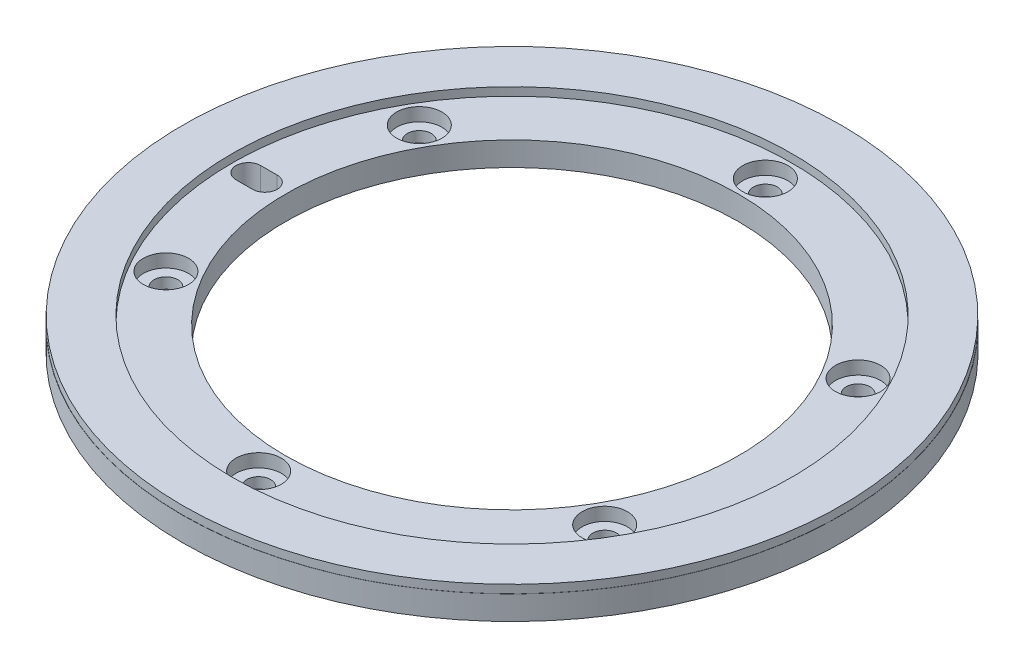
ISO-10303-21;
HEADER;
FILE_DESCRIPTION(('STEP AP214'),'2;1');
FILE_NAME('part.step','',(''),(''),'','','');
FILE_SCHEMA(('AUTOMOTIVE_DESIGN { 1 0 10303 214 1 1 1 1 }'));
ENDSEC;
DATA;
#1=APPLICATION_CONTEXT('core data for automotive mechanical design processes');
#2=APPLICATION_PROTOCOL_DEFINITION('international standard','automotive_design',2000,#1);
#3=PRODUCT_CONTEXT('',#1,'mechanical');
#4=PRODUCT('Part','Part','',(#3));
#5=PRODUCT_RELATED_PRODUCT_CATEGORY('part','',(#4));
#6=PRODUCT_DEFINITION_FORMATION('','',#4);
#7=PRODUCT_DEFINITION_CONTEXT('part definition',#1,'design');
#8=PRODUCT_DEFINITION('design','',#6,#7);
#9=PRODUCT_DEFINITION_SHAPE('','',#8);
#10=(LENGTH_UNIT() NAMED_UNIT(*) SI_UNIT(.MILLI.,.METRE.));
#11=(NAMED_UNIT(*) PLANE_ANGLE_UNIT() SI_UNIT($,.RADIAN.));
#12=(NAMED_UNIT(*) SI_UNIT($,.STERADIAN.) SOLID_ANGLE_UNIT());
#13=UNCERTAINTY_MEASURE_WITH_UNIT(LENGTH_MEASURE(1.E-05),#10,'distance_accuracy_value','');
#14=(GEOMETRIC_REPRESENTATION_CONTEXT(3) GLOBAL_UNCERTAINTY_ASSIGNED_CONTEXT((#13)) GLOBAL_UNIT_ASSIGNED_CONTEXT((#10,
#11,#12)) REPRESENTATION_CONTEXT('',''));
#15=CARTESIAN_POINT('',(0.,0.,0.));
#16=DIRECTION('',(0.,0.,1.));
#17=DIRECTION('',(1.,0.,0.));
#18=AXIS2_PLACEMENT_3D('',#15,#16,#17);
#19=CARTESIAN_POINT('',(-27.5,2.9,0.));
#20=DIRECTION('',(0.,-1.,0.));
#21=DIRECTION('',(0.,0.,-1.));
#22=AXIS2_PLACEMENT_3D('',#19,#20,#21);
#23=PLANE('',#22);
#24=CARTESIAN_POINT('',(0.,2.9,0.));
#25=DIRECTION('',(0.,-1.,0.));
#26=DIRECTION('',(0.,0.,-1.));
#27=AXIS2_PLACEMENT_3D('',#24,#25,#26);
#28=CIRCLE('',#27,40.);
#29=CARTESIAN_POINT('',(0.,2.9,-40.));
#30=VERTEX_POINT('',#29);
#31=EDGE_CURVE('E166',#30,#30,#28,.T.);
#32=ORIENTED_EDGE('',*,*,#31,.F.);
#33=EDGE_LOOP('',(#32));
#34=FACE_BOUND('',#33,.T.);
#35=CARTESIAN_POINT('',(0.,2.9,0.));
#36=DIRECTION('',(0.,-1.,0.));
#37=DIRECTION('',(0.,0.,-1.));
#38=AXIS2_PLACEMENT_3D('',#35,#36,#37);
#39=CIRCLE('',#38,39.98);
#40=CARTESIAN_POINT('',(0.,2.9,-39.98));
#41=VERTEX_POINT('',#40);
#42=EDGE_CURVE('E11',#41,#41,#39,.F.);
#43=ORIENTED_EDGE('',*,*,#42,.F.);
#44=EDGE_LOOP('',(#43));
#45=FACE_BOUND('',#44,.T.);
#46=ADVANCED_FACE('F31',(#34,#45),#23,.F.);
#47=CARTESIAN_POINT('',(0.,-3.24386032345393,0.));
#48=DIRECTION('',(0.,-1.,0.));
#49=DIRECTION('',(0.,0.,-1.));
#50=AXIS2_PLACEMENT_3D('',#47,#48,#49);
#51=CYLINDRICAL_SURFACE('',#50,27.5);
#52=CARTESIAN_POINT('',(0.,2.9,0.));
#53=DIRECTION('',(0.,-1.,0.));
#54=DIRECTION('',(0.,0.,-1.));
#55=AXIS2_PLACEMENT_3D('',#52,#53,#54);
#56=CIRCLE('',#55,27.5);
#57=CARTESIAN_POINT('',(0.,2.9,-27.5));
#58=VERTEX_POINT('',#57);
#59=EDGE_CURVE('E169',#58,#58,#56,.T.);
#60=ORIENTED_EDGE('',*,*,#59,.F.);
#61=EDGE_LOOP('',(#60));
#62=FACE_BOUND('',#61,.T.);
#63=CARTESIAN_POINT('',(0.,0.,0.));
#64=DIRECTION('',(0.,-1.,0.));
#65=DIRECTION('',(0.,0.,-1.));
#66=AXIS2_PLACEMENT_3D('',#63,#64,#65);
#67=CIRCLE('',#66,27.5);
#68=CARTESIAN_POINT('',(0.,0.,-27.5));
#69=VERTEX_POINT('',#68);
#70=EDGE_CURVE('E160',#69,#69,#67,.T.);
#71=ORIENTED_EDGE('',*,*,#70,.T.);
#72=EDGE_LOOP('',(#71));
#73=FACE_BOUND('',#72,.T.);
#74=ADVANCED_FACE('F33',(#62,#73),#51,.F.);
#75=CARTESIAN_POINT('',(0.,2.9,0.));
#76=DIRECTION('',(0.,1.,0.));
#77=DIRECTION('',(0.,0.,1.));
#78=AXIS2_PLACEMENT_3D('',#75,#76,#77);
#79=CIRCLE('',#78,34.);
#80=CARTESIAN_POINT('',(0.,2.9,34.));
#81=VERTEX_POINT('',#80);
#82=EDGE_CURVE('E202',#81,#81,#79,.T.);
#83=ORIENTED_EDGE('',*,*,#82,.T.);
#84=EDGE_LOOP('',(#83));
#85=FACE_BOUND('',#84,.T.);
#86=DIRECTION('',(1.,0.,0.));
#87=VECTOR('',#86,1.);
#88=CARTESIAN_POINT('',(-32.,2.9,1.5));
#89=LINE('',#88,#87);
#90=CARTESIAN_POINT('',(-32.,2.9,1.5));
#91=VERTEX_POINT('',#90);
#92=CARTESIAN_POINT('',(-30.,2.9,1.5));
#93=VERTEX_POINT('',#92);
#94=EDGE_CURVE('E84',#91,#93,#89,.T.);
#95=ORIENTED_EDGE('',*,*,#94,.F.);
#96=CARTESIAN_POINT('',(-32.,2.9,0.));
#97=DIRECTION('',(0.,1.,0.));
#98=DIRECTION('',(0.,0.,1.));
#99=AXIS2_PLACEMENT_3D('',#96,#97,#98);
#100=CIRCLE('',#99,1.5);
#101=CARTESIAN_POINT('',(-32.,2.9,-1.5));
#102=VERTEX_POINT('',#101);
#103=EDGE_CURVE('E46',#102,#91,#100,.T.);
#104=ORIENTED_EDGE('',*,*,#103,.F.);
#105=DIRECTION('',(-1.,0.,0.));
#106=VECTOR('',#105,1.);
#107=CARTESIAN_POINT('',(-32.,2.9,-1.5));
#108=LINE('',#107,#106);
#109=CARTESIAN_POINT('',(-30.,2.9,-1.5));
#110=VERTEX_POINT('',#109);
#111=EDGE_CURVE('E91',#110,#102,#108,.T.);
#112=ORIENTED_EDGE('',*,*,#111,.F.);
#113=CARTESIAN_POINT('',(-30.,2.9,0.));
#114=DIRECTION('',(0.,1.,0.));
#115=DIRECTION('',(0.,0.,1.));
#116=AXIS2_PLACEMENT_3D('',#113,#114,#115);
#117=CIRCLE('',#116,1.5);
#118=EDGE_CURVE('E75',#93,#110,#117,.T.);
#119=ORIENTED_EDGE('',*,*,#118,.F.);
#120=EDGE_LOOP('',(#95,#104,#112,#119));
#121=FACE_BOUND('',#120,.T.);
#122=CARTESIAN_POINT('',(-26.6302811663713,2.9,-15.3750000000003));
#123=DIRECTION('',(0.,-1.,0.));
#124=DIRECTION('',(0.,0.,-1.));
#125=AXIS2_PLACEMENT_3D('',#122,#123,#124);
#126=CIRCLE('',#125,2.75);
#127=CARTESIAN_POINT('',(-26.6302811663713,2.9,-18.1250000000003));
#128=VERTEX_POINT('',#127);
#129=EDGE_CURVE('E109',#128,#128,#126,.T.);
#130=ORIENTED_EDGE('',*,*,#129,.T.);
#131=EDGE_LOOP('',(#130));
#132=FACE_BOUND('',#131,.T.);
#133=CARTESIAN_POINT('',(-26.6302811663716,2.9,15.3749999999998));
#134=DIRECTION('',(0.,-1.,0.));
#135=DIRECTION('',(0.,0.,-1.));
#136=AXIS2_PLACEMENT_3D('',#133,#134,#135);
#137=CIRCLE('',#136,2.75);
#138=CARTESIAN_POINT('',(-26.6302811663716,2.9,12.6249999999998));
#139=VERTEX_POINT('',#138);
#140=EDGE_CURVE('E119',#139,#139,#137,.T.);
#141=ORIENTED_EDGE('',*,*,#140,.T.);
#142=EDGE_LOOP('',(#141));
#143=FACE_BOUND('',#142,.T.);
#144=CARTESIAN_POINT('',(0.,2.9,30.75));
#145=DIRECTION('',(0.,-1.,0.));
#146=DIRECTION('',(0.,0.,-1.));
#147=AXIS2_PLACEMENT_3D('',#144,#145,#146);
#148=CIRCLE('',#147,2.75);
#149=CARTESIAN_POINT('',(0.,2.9,28.));
#150=VERTEX_POINT('',#149);
#151=EDGE_CURVE('E129',#150,#150,#148,.T.);
#152=ORIENTED_EDGE('',*,*,#151,.T.);
#153=EDGE_LOOP('',(#152));
#154=FACE_BOUND('',#153,.T.);
#155=CARTESIAN_POINT('',(26.6302811663714,2.9,15.3750000000001));
#156=DIRECTION('',(0.,-1.,0.));
#157=DIRECTION('',(0.,0.,-1.));
#158=AXIS2_PLACEMENT_3D('',#155,#156,#157);
#159=CIRCLE('',#158,2.75);
#160=CARTESIAN_POINT('',(26.6302811663714,2.9,12.6250000000001));
#161=VERTEX_POINT('',#160);
#162=EDGE_CURVE('E139',#161,#161,#159,.T.);
#163=ORIENTED_EDGE('',*,*,#162,.T.);
#164=EDGE_LOOP('',(#163));
#165=FACE_BOUND('',#164,.T.);
#166=CARTESIAN_POINT('',(26.6302811663715,2.9,-15.3749999999999));
#167=DIRECTION('',(0.,-1.,0.));
#168=DIRECTION('',(0.,0.,-1.));
#169=AXIS2_PLACEMENT_3D('',#166,#167,#168);
#170=CIRCLE('',#169,2.75);
#171=CARTESIAN_POINT('',(26.6302811663715,2.9,-18.1249999999999));
#172=VERTEX_POINT('',#171);
#173=EDGE_CURVE('E149',#172,#172,#170,.T.);
#174=ORIENTED_EDGE('',*,*,#173,.T.);
#175=EDGE_LOOP('',(#174));
#176=FACE_BOUND('',#175,.T.);
#177=CARTESIAN_POINT('',(0.,2.9,-30.75));
#178=DIRECTION('',(0.,-1.,0.));
#179=DIRECTION('',(0.,0.,-1.));
#180=AXIS2_PLACEMENT_3D('',#177,#178,#179);
#181=CIRCLE('',#180,2.75);
#182=CARTESIAN_POINT('',(0.,2.9,-33.5));
#183=VERTEX_POINT('',#182);
#184=EDGE_CURVE('E159',#183,#183,#181,.T.);
#185=ORIENTED_EDGE('',*,*,#184,.T.);
#186=EDGE_LOOP('',(#185));
#187=FACE_BOUND('',#186,.T.);
#188=ORIENTED_EDGE('',*,*,#59,.T.);
#189=EDGE_LOOP('',(#188));
#190=FACE_BOUND('',#189,.T.);
#191=ADVANCED_FACE('F88',(#85,#121,#132,#143,#154,#165,#176,#187,#190),#23,.F.);
#192=CARTESIAN_POINT('',(0.,-3.24386032345393,0.));
#193=DIRECTION('',(0.,-1.,0.));
#194=DIRECTION('',(0.,0.,-1.));
#195=AXIS2_PLACEMENT_3D('',#192,#193,#194);
#196=CYLINDRICAL_SURFACE('',#195,40.);
#197=CARTESIAN_POINT('',(0.,0.,0.));
#198=DIRECTION('',(0.,-1.,0.));
#199=DIRECTION('',(0.,0.,-1.));
#200=AXIS2_PLACEMENT_3D('',#197,#198,#199);
#201=CIRCLE('',#200,40.);
#202=CARTESIAN_POINT('',(0.,0.,-40.));
#203=VERTEX_POINT('',#202);
#204=EDGE_CURVE('E163',#203,#203,#201,.T.);
#205=ORIENTED_EDGE('',*,*,#204,.F.);
#206=EDGE_LOOP('',(#205));
#207=FACE_BOUND('',#206,.T.);
#208=ORIENTED_EDGE('',*,*,#31,.T.);
#209=EDGE_LOOP('',(#208));
#210=FACE_BOUND('',#209,.T.);
#211=ADVANCED_FACE('F234',(#207,#210),#196,.T.);
#212=CARTESIAN_POINT('',(-27.5,0.,0.));
#213=DIRECTION('',(0.,1.,0.));
#214=DIRECTION('',(0.,0.,1.));
#215=AXIS2_PLACEMENT_3D('',#212,#213,#214);
#216=PLANE('',#215);
#217=DIRECTION('',(-1.,0.,0.));
#218=VECTOR('',#217,1.);
#219=CARTESIAN_POINT('',(-27.5,0.,-1.5));
#220=LINE('',#219,#218);
#221=CARTESIAN_POINT('',(-30.,0.,-1.5));
#222=VERTEX_POINT('',#221);
#223=CARTESIAN_POINT('',(-32.,0.,-1.5));
#224=VERTEX_POINT('',#223);
#225=EDGE_CURVE('E187',#222,#224,#220,.T.);
#226=ORIENTED_EDGE('',*,*,#225,.T.);
#227=CARTESIAN_POINT('',(-32.,0.,0.));
#228=DIRECTION('',(0.,1.,0.));
#229=DIRECTION('',(0.,0.,1.));
#230=AXIS2_PLACEMENT_3D('',#227,#228,#229);
#231=CIRCLE('',#230,1.5);
#232=CARTESIAN_POINT('',(-32.,0.,1.5));
#233=VERTEX_POINT('',#232);
#234=EDGE_CURVE('E39',#224,#233,#231,.T.);
#235=ORIENTED_EDGE('',*,*,#234,.T.);
#236=DIRECTION('',(1.,0.,0.));
#237=VECTOR('',#236,1.);
#238=CARTESIAN_POINT('',(-27.5,0.,1.5));
#239=LINE('',#238,#237);
#240=CARTESIAN_POINT('',(-30.,0.,1.5));
#241=VERTEX_POINT('',#240);
#242=EDGE_CURVE('E172',#233,#241,#239,.T.);
#243=ORIENTED_EDGE('',*,*,#242,.T.);
#244=CARTESIAN_POINT('',(-30.,0.,0.));
#245=DIRECTION('',(0.,1.,0.));
#246=DIRECTION('',(0.,0.,1.));
#247=AXIS2_PLACEMENT_3D('',#244,#245,#246);
#248=CIRCLE('',#247,1.5);
#249=EDGE_CURVE('E78',#241,#222,#248,.T.);
#250=ORIENTED_EDGE('',*,*,#249,.T.);
#251=EDGE_LOOP('',(#226,#235,#243,#250));
#252=FACE_BOUND('',#251,.T.);
#253=CARTESIAN_POINT('',(-26.6302811663713,0.,-15.3750000000003));
#254=DIRECTION('',(0.,1.,0.));
#255=DIRECTION('',(0.,0.,1.));
#256=AXIS2_PLACEMENT_3D('',#253,#254,#255);
#257=CIRCLE('',#256,1.45);
#258=CARTESIAN_POINT('',(-26.6302811663713,0.,-13.9250000000003));
#259=VERTEX_POINT('',#258);
#260=EDGE_CURVE('E106',#259,#259,#257,.T.);
#261=ORIENTED_EDGE('',*,*,#260,.T.);
#262=EDGE_LOOP('',(#261));
#263=FACE_BOUND('',#262,.T.);
#264=CARTESIAN_POINT('',(-26.6302811663716,0.,15.3749999999998));
#265=DIRECTION('',(0.,1.,0.));
#266=DIRECTION('',(0.,0.,1.));
#267=AXIS2_PLACEMENT_3D('',#264,#265,#266);
#268=CIRCLE('',#267,1.45);
#269=CARTESIAN_POINT('',(-26.6302811663716,0.,16.8249999999998));
#270=VERTEX_POINT('',#269);
#271=EDGE_CURVE('E116',#270,#270,#268,.T.);
#272=ORIENTED_EDGE('',*,*,#271,.T.);
#273=EDGE_LOOP('',(#272));
#274=FACE_BOUND('',#273,.T.);
#275=CARTESIAN_POINT('',(0.,0.,30.75));
#276=DIRECTION('',(0.,1.,0.));
#277=DIRECTION('',(0.,0.,1.));
#278=AXIS2_PLACEMENT_3D('',#275,#276,#277);
#279=CIRCLE('',#278,1.45);
#280=CARTESIAN_POINT('',(0.,0.,32.2));
#281=VERTEX_POINT('',#280);
#282=EDGE_CURVE('E126',#281,#281,#279,.T.);
#283=ORIENTED_EDGE('',*,*,#282,.T.);
#284=EDGE_LOOP('',(#283));
#285=FACE_BOUND('',#284,.T.);
#286=CARTESIAN_POINT('',(26.6302811663714,0.,15.3750000000001));
#287=DIRECTION('',(0.,1.,0.));
#288=DIRECTION('',(0.,0.,1.));
#289=AXIS2_PLACEMENT_3D('',#286,#287,#288);
#290=CIRCLE('',#289,1.45);
#291=CARTESIAN_POINT('',(26.6302811663714,0.,16.8250000000001));
#292=VERTEX_POINT('',#291);
#293=EDGE_CURVE('E136',#292,#292,#290,.T.);
#294=ORIENTED_EDGE('',*,*,#293,.T.);
#295=EDGE_LOOP('',(#294));
#296=FACE_BOUND('',#295,.T.);
#297=CARTESIAN_POINT('',(26.6302811663715,0.,-15.3749999999999));
#298=DIRECTION('',(0.,1.,0.));
#299=DIRECTION('',(0.,0.,1.));
#300=AXIS2_PLACEMENT_3D('',#297,#298,#299);
#301=CIRCLE('',#300,1.45);
#302=CARTESIAN_POINT('',(26.6302811663715,0.,-13.9249999999999));
#303=VERTEX_POINT('',#302);
#304=EDGE_CURVE('E146',#303,#303,#301,.T.);
#305=ORIENTED_EDGE('',*,*,#304,.T.);
#306=EDGE_LOOP('',(#305));
#307=FACE_BOUND('',#306,.T.);
#308=CARTESIAN_POINT('',(0.,0.,-30.75));
#309=DIRECTION('',(0.,1.,0.));
#310=DIRECTION('',(0.,0.,1.));
#311=AXIS2_PLACEMENT_3D('',#308,#309,#310);
#312=CIRCLE('',#311,1.45);
#313=CARTESIAN_POINT('',(0.,0.,-29.3));
#314=VERTEX_POINT('',#313);
#315=EDGE_CURVE('E156',#314,#314,#312,.T.);
#316=ORIENTED_EDGE('',*,*,#315,.T.);
#317=EDGE_LOOP('',(#316));
#318=FACE_BOUND('',#317,.T.);
#319=ORIENTED_EDGE('',*,*,#70,.F.);
#320=EDGE_LOOP('',(#319));
#321=FACE_BOUND('',#320,.T.);
#322=ORIENTED_EDGE('',*,*,#204,.T.);
#323=EDGE_LOOP('',(#322));
#324=FACE_BOUND('',#323,.T.);
#325=ADVANCED_FACE('F191',(#252,#263,#274,#285,#296,#307,#318,#321,#324),#216,.F.);
#326=CARTESIAN_POINT('',(0.,3.4,-30.75));
#327=DIRECTION('',(0.,1.,0.));
#328=DIRECTION('',(0.,0.,1.));
#329=AXIS2_PLACEMENT_3D('',#326,#327,#328);
#330=CYLINDRICAL_SURFACE('',#329,2.75);
#331=CARTESIAN_POINT('',(0.,1.3,-30.75));
#332=DIRECTION('',(0.,1.,0.));
#333=DIRECTION('',(0.,0.,1.));
#334=AXIS2_PLACEMENT_3D('',#331,#332,#333);
#335=CIRCLE('',#334,2.75);
#336=CARTESIAN_POINT('',(0.,1.3,-28.));
#337=VERTEX_POINT('',#336);
#338=EDGE_CURVE('E150',#337,#337,#335,.T.);
#339=ORIENTED_EDGE('',*,*,#338,.F.);
#340=EDGE_LOOP('',(#339));
#341=FACE_BOUND('',#340,.T.);
#342=ORIENTED_EDGE('',*,*,#184,.F.);
#343=EDGE_LOOP('',(#342));
#344=FACE_BOUND('',#343,.T.);
#345=ADVANCED_FACE('F304',(#341,#344),#330,.F.);
#346=CARTESIAN_POINT('',(0.,3.4,-30.75));
#347=DIRECTION('',(0.,1.,0.));
#348=DIRECTION('',(0.,0.,1.));
#349=AXIS2_PLACEMENT_3D('',#346,#347,#348);
#350=CYLINDRICAL_SURFACE('',#349,1.45);
#351=ORIENTED_EDGE('',*,*,#315,.F.);
#352=EDGE_LOOP('',(#351));
#353=FACE_BOUND('',#352,.T.);
#354=CARTESIAN_POINT('',(0.,1.3,-30.75));
#355=DIRECTION('',(0.,1.,0.));
#356=DIRECTION('',(0.,0.,1.));
#357=AXIS2_PLACEMENT_3D('',#354,#355,#356);
#358=CIRCLE('',#357,1.45);
#359=CARTESIAN_POINT('',(0.,1.3,-29.3));
#360=VERTEX_POINT('',#359);
#361=EDGE_CURVE('E153',#360,#360,#358,.T.);
#362=ORIENTED_EDGE('',*,*,#361,.T.);
#363=EDGE_LOOP('',(#362));
#364=FACE_BOUND('',#363,.T.);
#365=ADVANCED_FACE('F463',(#353,#364),#350,.F.);
#366=CARTESIAN_POINT('',(1.45,1.3,-30.75));
#367=DIRECTION('',(0.,-1.,0.));
#368=DIRECTION('',(0.,0.,-1.));
#369=AXIS2_PLACEMENT_3D('',#366,#367,#368);
#370=PLANE('',#369);
#371=ORIENTED_EDGE('',*,*,#361,.F.);
#372=EDGE_LOOP('',(#371));
#373=FACE_BOUND('',#372,.T.);
#374=ORIENTED_EDGE('',*,*,#338,.T.);
#375=EDGE_LOOP('',(#374));
#376=FACE_BOUND('',#375,.T.);
#377=ADVANCED_FACE('F453',(#373,#376),#370,.F.);
#378=CARTESIAN_POINT('',(26.6302811663715,3.4,-15.3749999999999));
#379=DIRECTION('',(0.,1.,0.));
#380=DIRECTION('',(0.,0.,1.));
#381=AXIS2_PLACEMENT_3D('',#378,#379,#380);
#382=CYLINDRICAL_SURFACE('',#381,2.75);
#383=CARTESIAN_POINT('',(26.6302811663715,1.3,-15.3749999999999));
#384=DIRECTION('',(0.,1.,0.));
#385=DIRECTION('',(0.,0.,1.));
#386=AXIS2_PLACEMENT_3D('',#383,#384,#385);
#387=CIRCLE('',#386,2.75);
#388=CARTESIAN_POINT('',(26.6302811663715,1.3,-12.6249999999999));
#389=VERTEX_POINT('',#388);
#390=EDGE_CURVE('E140',#389,#389,#387,.T.);
#391=ORIENTED_EDGE('',*,*,#390,.F.);
#392=EDGE_LOOP('',(#391));
#393=FACE_BOUND('',#392,.T.);
#394=ORIENTED_EDGE('',*,*,#173,.F.);
#395=EDGE_LOOP('',(#394));
#396=FACE_BOUND('',#395,.T.);
#397=ADVANCED_FACE('F443',(#393,#396),#382,.F.);
#398=CARTESIAN_POINT('',(26.6302811663715,3.4,-15.3749999999999));
#399=DIRECTION('',(0.,1.,0.));
#400=DIRECTION('',(0.,0.,1.));
#401=AXIS2_PLACEMENT_3D('',#398,#399,#400);
#402=CYLINDRICAL_SURFACE('',#401,1.45);
#403=ORIENTED_EDGE('',*,*,#304,.F.);
#404=EDGE_LOOP('',(#403));
#405=FACE_BOUND('',#404,.T.);
#406=CARTESIAN_POINT('',(26.6302811663715,1.3,-15.3749999999999));
#407=DIRECTION('',(0.,1.,0.));
#408=DIRECTION('',(0.,0.,1.));
#409=AXIS2_PLACEMENT_3D('',#406,#407,#408);
#410=CIRCLE('',#409,1.45);
#411=CARTESIAN_POINT('',(26.6302811663715,1.3,-13.9249999999999));
#412=VERTEX_POINT('',#411);
#413=EDGE_CURVE('E143',#412,#412,#410,.T.);
#414=ORIENTED_EDGE('',*,*,#413,.T.);
#415=EDGE_LOOP('',(#414));
#416=FACE_BOUND('',#415,.T.);
#417=ADVANCED_FACE('F433',(#405,#416),#402,.F.);
#418=CARTESIAN_POINT('',(28.0802811663715,1.3,-15.3749999999999));
#419=DIRECTION('',(0.,-1.,0.));
#420=DIRECTION('',(0.,0.,-1.));
#421=AXIS2_PLACEMENT_3D('',#418,#419,#420);
#422=PLANE('',#421);
#423=ORIENTED_EDGE('',*,*,#413,.F.);
#424=EDGE_LOOP('',(#423));
#425=FACE_BOUND('',#424,.T.);
#426=ORIENTED_EDGE('',*,*,#390,.T.);
#427=EDGE_LOOP('',(#426));
#428=FACE_BOUND('',#427,.T.);
#429=ADVANCED_FACE('F423',(#425,#428),#422,.F.);
#430=CARTESIAN_POINT('',(26.6302811663714,3.4,15.3750000000001));
#431=DIRECTION('',(0.,1.,0.));
#432=DIRECTION('',(0.,0.,1.));
#433=AXIS2_PLACEMENT_3D('',#430,#431,#432);
#434=CYLINDRICAL_SURFACE('',#433,2.75);
#435=CARTESIAN_POINT('',(26.6302811663714,1.3,15.3750000000001));
#436=DIRECTION('',(0.,1.,0.));
#437=DIRECTION('',(0.,0.,1.));
#438=AXIS2_PLACEMENT_3D('',#435,#436,#437);
#439=CIRCLE('',#438,2.75);
#440=CARTESIAN_POINT('',(26.6302811663714,1.3,18.1250000000001));
#441=VERTEX_POINT('',#440);
#442=EDGE_CURVE('E130',#441,#441,#439,.T.);
#443=ORIENTED_EDGE('',*,*,#442,.F.);
#444=EDGE_LOOP('',(#443));
#445=FACE_BOUND('',#444,.T.);
#446=ORIENTED_EDGE('',*,*,#162,.F.);
#447=EDGE_LOOP('',(#446));
#448=FACE_BOUND('',#447,.T.);
#449=ADVANCED_FACE('F413',(#445,#448),#434,.F.);
#450=CARTESIAN_POINT('',(26.6302811663714,3.4,15.3750000000001));
#451=DIRECTION('',(0.,1.,0.));
#452=DIRECTION('',(0.,0.,1.));
#453=AXIS2_PLACEMENT_3D('',#450,#451,#452);
#454=CYLINDRICAL_SURFACE('',#453,1.45);
#455=ORIENTED_EDGE('',*,*,#293,.F.);
#456=EDGE_LOOP('',(#455));
#457=FACE_BOUND('',#456,.T.);
#458=CARTESIAN_POINT('',(26.6302811663714,1.3,15.3750000000001));
#459=DIRECTION('',(0.,1.,0.));
#460=DIRECTION('',(0.,0.,1.));
#461=AXIS2_PLACEMENT_3D('',#458,#459,#460);
#462=CIRCLE('',#461,1.45);
#463=CARTESIAN_POINT('',(26.6302811663714,1.3,16.8250000000001));
#464=VERTEX_POINT('',#463);
#465=EDGE_CURVE('E133',#464,#464,#462,.T.);
#466=ORIENTED_EDGE('',*,*,#465,.T.);
#467=EDGE_LOOP('',(#466));
#468=FACE_BOUND('',#467,.T.);
#469=ADVANCED_FACE('F403',(#457,#468),#454,.F.);
#470=CARTESIAN_POINT('',(28.0802811663714,1.3,15.3750000000001));
#471=DIRECTION('',(0.,-1.,0.));
#472=DIRECTION('',(0.,0.,-1.));
#473=AXIS2_PLACEMENT_3D('',#470,#471,#472);
#474=PLANE('',#473);
#475=ORIENTED_EDGE('',*,*,#465,.F.);
#476=EDGE_LOOP('',(#475));
#477=FACE_BOUND('',#476,.T.);
#478=ORIENTED_EDGE('',*,*,#442,.T.);
#479=EDGE_LOOP('',(#478));
#480=FACE_BOUND('',#479,.T.);
#481=ADVANCED_FACE('F393',(#477,#480),#474,.F.);
#482=CARTESIAN_POINT('',(0.,3.4,30.75));
#483=DIRECTION('',(0.,1.,0.));
#484=DIRECTION('',(0.,0.,1.));
#485=AXIS2_PLACEMENT_3D('',#482,#483,#484);
#486=CYLINDRICAL_SURFACE('',#485,2.75);
#487=CARTESIAN_POINT('',(0.,1.3,30.75));
#488=DIRECTION('',(0.,1.,0.));
#489=DIRECTION('',(0.,0.,1.));
#490=AXIS2_PLACEMENT_3D('',#487,#488,#489);
#491=CIRCLE('',#490,2.75);
#492=CARTESIAN_POINT('',(0.,1.3,33.5));
#493=VERTEX_POINT('',#492);
#494=EDGE_CURVE('E120',#493,#493,#491,.T.);
#495=ORIENTED_EDGE('',*,*,#494,.F.);
#496=EDGE_LOOP('',(#495));
#497=FACE_BOUND('',#496,.T.);
#498=ORIENTED_EDGE('',*,*,#151,.F.);
#499=EDGE_LOOP('',(#498));
#500=FACE_BOUND('',#499,.T.);
#501=ADVANCED_FACE('F383',(#497,#500),#486,.F.);
#502=CARTESIAN_POINT('',(0.,3.4,30.75));
#503=DIRECTION('',(0.,1.,0.));
#504=DIRECTION('',(0.,0.,1.));
#505=AXIS2_PLACEMENT_3D('',#502,#503,#504);
#506=CYLINDRICAL_SURFACE('',#505,1.45);
#507=ORIENTED_EDGE('',*,*,#282,.F.);
#508=EDGE_LOOP('',(#507));
#509=FACE_BOUND('',#508,.T.);
#510=CARTESIAN_POINT('',(0.,1.3,30.75));
#511=DIRECTION('',(0.,1.,0.));
#512=DIRECTION('',(0.,0.,1.));
#513=AXIS2_PLACEMENT_3D('',#510,#511,#512);
#514=CIRCLE('',#513,1.45);
#515=CARTESIAN_POINT('',(0.,1.3,32.2));
#516=VERTEX_POINT('',#515);
#517=EDGE_CURVE('E123',#516,#516,#514,.T.);
#518=ORIENTED_EDGE('',*,*,#517,.T.);
#519=EDGE_LOOP('',(#518));
#520=FACE_BOUND('',#519,.T.);
#521=ADVANCED_FACE('F373',(#509,#520),#506,.F.);
#522=CARTESIAN_POINT('',(1.45,1.3,30.75));
#523=DIRECTION('',(0.,-1.,0.));
#524=DIRECTION('',(0.,0.,-1.));
#525=AXIS2_PLACEMENT_3D('',#522,#523,#524);
#526=PLANE('',#525);
#527=ORIENTED_EDGE('',*,*,#517,.F.);
#528=EDGE_LOOP('',(#527));
#529=FACE_BOUND('',#528,.T.);
#530=ORIENTED_EDGE('',*,*,#494,.T.);
#531=EDGE_LOOP('',(#530));
#532=FACE_BOUND('',#531,.T.);
#533=ADVANCED_FACE('F363',(#529,#532),#526,.F.);
#534=CARTESIAN_POINT('',(-26.6302811663716,3.4,15.3749999999998));
#535=DIRECTION('',(0.,1.,0.));
#536=DIRECTION('',(0.,0.,1.));
#537=AXIS2_PLACEMENT_3D('',#534,#535,#536);
#538=CYLINDRICAL_SURFACE('',#537,2.75);
#539=CARTESIAN_POINT('',(-26.6302811663716,1.3,15.3749999999998));
#540=DIRECTION('',(0.,1.,0.));
#541=DIRECTION('',(0.,0.,1.));
#542=AXIS2_PLACEMENT_3D('',#539,#540,#541);
#543=CIRCLE('',#542,2.75);
#544=CARTESIAN_POINT('',(-26.6302811663716,1.3,18.1249999999998));
#545=VERTEX_POINT('',#544);
#546=EDGE_CURVE('E110',#545,#545,#543,.T.);
#547=ORIENTED_EDGE('',*,*,#546,.F.);
#548=EDGE_LOOP('',(#547));
#549=FACE_BOUND('',#548,.T.);
#550=ORIENTED_EDGE('',*,*,#140,.F.);
#551=EDGE_LOOP('',(#550));
#552=FACE_BOUND('',#551,.T.);
#553=ADVANCED_FACE('F353',(#549,#552),#538,.F.);
#554=CARTESIAN_POINT('',(-26.6302811663716,3.4,15.3749999999998));
#555=DIRECTION('',(0.,1.,0.));
#556=DIRECTION('',(0.,0.,1.));
#557=AXIS2_PLACEMENT_3D('',#554,#555,#556);
#558=CYLINDRICAL_SURFACE('',#557,1.45);
#559=ORIENTED_EDGE('',*,*,#271,.F.);
#560=EDGE_LOOP('',(#559));
#561=FACE_BOUND('',#560,.T.);
#562=CARTESIAN_POINT('',(-26.6302811663716,1.3,15.3749999999998));
#563=DIRECTION('',(0.,1.,0.));
#564=DIRECTION('',(0.,0.,1.));
#565=AXIS2_PLACEMENT_3D('',#562,#563,#564);
#566=CIRCLE('',#565,1.45);
#567=CARTESIAN_POINT('',(-26.6302811663716,1.3,16.8249999999998));
#568=VERTEX_POINT('',#567);
#569=EDGE_CURVE('E113',#568,#568,#566,.T.);
#570=ORIENTED_EDGE('',*,*,#569,.T.);
#571=EDGE_LOOP('',(#570));
#572=FACE_BOUND('',#571,.T.);
#573=ADVANCED_FACE('F343',(#561,#572),#558,.F.);
#574=CARTESIAN_POINT('',(-25.1802811663716,1.3,15.3749999999998));
#575=DIRECTION('',(0.,-1.,0.));
#576=DIRECTION('',(0.,0.,-1.));
#577=AXIS2_PLACEMENT_3D('',#574,#575,#576);
#578=PLANE('',#577);
#579=ORIENTED_EDGE('',*,*,#569,.F.);
#580=EDGE_LOOP('',(#579));
#581=FACE_BOUND('',#580,.T.);
#582=ORIENTED_EDGE('',*,*,#546,.T.);
#583=EDGE_LOOP('',(#582));
#584=FACE_BOUND('',#583,.T.);
#585=ADVANCED_FACE('F333',(#581,#584),#578,.F.);
#586=CARTESIAN_POINT('',(-26.6302811663713,3.4,-15.3750000000003));
#587=DIRECTION('',(0.,1.,0.));
#588=DIRECTION('',(0.,0.,1.));
#589=AXIS2_PLACEMENT_3D('',#586,#587,#588);
#590=CYLINDRICAL_SURFACE('',#589,2.75);
#591=CARTESIAN_POINT('',(-26.6302811663713,1.3,-15.3750000000003));
#592=DIRECTION('',(0.,1.,0.));
#593=DIRECTION('',(0.,0.,1.));
#594=AXIS2_PLACEMENT_3D('',#591,#592,#593);
#595=CIRCLE('',#594,2.75);
#596=CARTESIAN_POINT('',(-26.6302811663713,1.3,-12.6250000000003));
#597=VERTEX_POINT('',#596);
#598=EDGE_CURVE('E98',#597,#597,#595,.T.);
#599=ORIENTED_EDGE('',*,*,#598,.F.);
#600=EDGE_LOOP('',(#599));
#601=FACE_BOUND('',#600,.T.);
#602=ORIENTED_EDGE('',*,*,#129,.F.);
#603=EDGE_LOOP('',(#602));
#604=FACE_BOUND('',#603,.T.);
#605=ADVANCED_FACE('F323',(#601,#604),#590,.F.);
#606=CARTESIAN_POINT('',(-26.6302811663713,3.4,-15.3750000000003));
#607=DIRECTION('',(0.,1.,0.));
#608=DIRECTION('',(0.,0.,1.));
#609=AXIS2_PLACEMENT_3D('',#606,#607,#608);
#610=CYLINDRICAL_SURFACE('',#609,1.45);
#611=ORIENTED_EDGE('',*,*,#260,.F.);
#612=EDGE_LOOP('',(#611));
#613=FACE_BOUND('',#612,.T.);
#614=CARTESIAN_POINT('',(-26.6302811663713,1.3,-15.3750000000003));
#615=DIRECTION('',(0.,1.,0.));
#616=DIRECTION('',(0.,0.,1.));
#617=AXIS2_PLACEMENT_3D('',#614,#615,#616);
#618=CIRCLE('',#617,1.45);
#619=CARTESIAN_POINT('',(-26.6302811663713,1.3,-13.9250000000003));
#620=VERTEX_POINT('',#619);
#621=EDGE_CURVE('E103',#620,#620,#618,.T.);
#622=ORIENTED_EDGE('',*,*,#621,.T.);
#623=EDGE_LOOP('',(#622));
#624=FACE_BOUND('',#623,.T.);
#625=ADVANCED_FACE('F313',(#613,#624),#610,.F.);
#626=CARTESIAN_POINT('',(-25.1802811663713,1.3,-15.3750000000003));
#627=DIRECTION('',(0.,-1.,0.));
#628=DIRECTION('',(0.,0.,-1.));
#629=AXIS2_PLACEMENT_3D('',#626,#627,#628);
#630=PLANE('',#629);
#631=ORIENTED_EDGE('',*,*,#621,.F.);
#632=EDGE_LOOP('',(#631));
#633=FACE_BOUND('',#632,.T.);
#634=ORIENTED_EDGE('',*,*,#598,.T.);
#635=EDGE_LOOP('',(#634));
#636=FACE_BOUND('',#635,.T.);
#637=ADVANCED_FACE('F293',(#633,#636),#630,.F.);
#638=CARTESIAN_POINT('',(-32.,-7.1,0.));
#639=DIRECTION('',(0.,1.,0.));
#640=DIRECTION('',(0.,0.,1.));
#641=AXIS2_PLACEMENT_3D('',#638,#639,#640);
#642=CYLINDRICAL_SURFACE('',#641,1.5);
#643=DIRECTION('',(0.,1.,0.));
#644=VECTOR('',#643,1.);
#645=CARTESIAN_POINT('',(-32.,-7.1,-1.5));
#646=LINE('',#645,#644);
#647=EDGE_CURVE('E96',#224,#102,#646,.T.);
#648=ORIENTED_EDGE('',*,*,#647,.T.);
#649=ORIENTED_EDGE('',*,*,#103,.T.);
#650=DIRECTION('',(0.,1.,0.));
#651=VECTOR('',#650,1.);
#652=CARTESIAN_POINT('',(-32.,-7.1,1.5));
#653=LINE('',#652,#651);
#654=EDGE_CURVE('E81',#233,#91,#653,.T.);
#655=ORIENTED_EDGE('',*,*,#654,.F.);
#656=ORIENTED_EDGE('',*,*,#234,.F.);
#657=EDGE_LOOP('',(#648,#649,#655,#656));
#658=FACE_BOUND('',#657,.T.);
#659=ADVANCED_FACE('F194',(#658),#642,.F.);
#660=CARTESIAN_POINT('',(-32.,-7.1,-1.5));
#661=DIRECTION('',(0.,0.,-1.));
#662=DIRECTION('',(-1.,0.,0.));
#663=AXIS2_PLACEMENT_3D('',#660,#661,#662);
#664=PLANE('',#663);
#665=DIRECTION('',(0.,1.,0.));
#666=VECTOR('',#665,1.);
#667=CARTESIAN_POINT('',(-30.,-7.1,-1.5));
#668=LINE('',#667,#666);
#669=EDGE_CURVE('E80',#222,#110,#668,.T.);
#670=ORIENTED_EDGE('',*,*,#669,.T.);
#671=ORIENTED_EDGE('',*,*,#111,.T.);
#672=ORIENTED_EDGE('',*,*,#647,.F.);
#673=ORIENTED_EDGE('',*,*,#225,.F.);
#674=EDGE_LOOP('',(#670,#671,#672,#673));
#675=FACE_BOUND('',#674,.T.);
#676=ADVANCED_FACE('F196',(#675),#664,.F.);
#677=CARTESIAN_POINT('',(-30.,-7.1,0.));
#678=DIRECTION('',(0.,1.,0.));
#679=DIRECTION('',(0.,0.,1.));
#680=AXIS2_PLACEMENT_3D('',#677,#678,#679);
#681=CYLINDRICAL_SURFACE('',#680,1.5);
#682=DIRECTION('',(0.,1.,0.));
#683=VECTOR('',#682,1.);
#684=CARTESIAN_POINT('',(-30.,-7.1,1.5));
#685=LINE('',#684,#683);
#686=EDGE_CURVE('E54',#241,#93,#685,.T.);
#687=ORIENTED_EDGE('',*,*,#686,.T.);
#688=ORIENTED_EDGE('',*,*,#118,.T.);
#689=ORIENTED_EDGE('',*,*,#669,.F.);
#690=ORIENTED_EDGE('',*,*,#249,.F.);
#691=EDGE_LOOP('',(#687,#688,#689,#690));
#692=FACE_BOUND('',#691,.T.);
#693=ADVANCED_FACE('F72',(#692),#681,.F.);
#694=CARTESIAN_POINT('',(-32.,-7.1,1.5));
#695=DIRECTION('',(0.,0.,1.));
#696=DIRECTION('',(1.,0.,0.));
#697=AXIS2_PLACEMENT_3D('',#694,#695,#696);
#698=PLANE('',#697);
#699=ORIENTED_EDGE('',*,*,#654,.T.);
#700=ORIENTED_EDGE('',*,*,#94,.T.);
#701=ORIENTED_EDGE('',*,*,#686,.F.);
#702=ORIENTED_EDGE('',*,*,#242,.F.);
#703=EDGE_LOOP('',(#699,#700,#701,#702));
#704=FACE_BOUND('',#703,.T.);
#705=ADVANCED_FACE('F85',(#704),#698,.F.);
#706=CARTESIAN_POINT('',(0.,3.9,0.));
#707=DIRECTION('',(0.,1.,0.));
#708=DIRECTION('',(0.,0.,1.));
#709=AXIS2_PLACEMENT_3D('',#706,#707,#708);
#710=PLANE('',#709);
#711=CARTESIAN_POINT('',(0.,3.9,0.));
#712=DIRECTION('',(0.,1.,0.));
#713=DIRECTION('',(0.,0.,1.));
#714=AXIS2_PLACEMENT_3D('',#711,#712,#713);
#715=CIRCLE('',#714,39.98);
#716=CARTESIAN_POINT('',(0.,3.9,39.98));
#717=VERTEX_POINT('',#716);
#718=EDGE_CURVE('E197',#717,#717,#715,.T.);
#719=ORIENTED_EDGE('',*,*,#718,.T.);
#720=EDGE_LOOP('',(#719));
#721=FACE_BOUND('',#720,.T.);
#722=CARTESIAN_POINT('',(0.,3.9,0.));
#723=DIRECTION('',(0.,1.,0.));
#724=DIRECTION('',(0.,0.,1.));
#725=AXIS2_PLACEMENT_3D('',#722,#723,#724);
#726=CIRCLE('',#725,34.);
#727=CARTESIAN_POINT('',(0.,3.9,34.));
#728=VERTEX_POINT('',#727);
#729=EDGE_CURVE('E199',#728,#728,#726,.T.);
#730=ORIENTED_EDGE('',*,*,#729,.F.);
#731=EDGE_LOOP('',(#730));
#732=FACE_BOUND('',#731,.T.);
#733=ADVANCED_FACE('F211',(#721,#732),#710,.T.);
#734=CARTESIAN_POINT('',(0.,3.9,0.));
#735=DIRECTION('',(0.,-1.,0.));
#736=DIRECTION('',(0.,0.,-1.));
#737=AXIS2_PLACEMENT_3D('',#734,#735,#736);
#738=CYLINDRICAL_SURFACE('',#737,39.98);
#739=ORIENTED_EDGE('',*,*,#718,.F.);
#740=EDGE_LOOP('',(#739));
#741=FACE_BOUND('',#740,.T.);
#742=ORIENTED_EDGE('',*,*,#42,.T.);
#743=EDGE_LOOP('',(#742));
#744=FACE_BOUND('',#743,.T.);
#745=ADVANCED_FACE('F213',(#741,#744),#738,.T.);
#746=CARTESIAN_POINT('',(0.,3.9,0.));
#747=DIRECTION('',(0.,-1.,0.));
#748=DIRECTION('',(0.,0.,-1.));
#749=AXIS2_PLACEMENT_3D('',#746,#747,#748);
#750=CYLINDRICAL_SURFACE('',#749,34.);
#751=ORIENTED_EDGE('',*,*,#729,.T.);
#752=EDGE_LOOP('',(#751));
#753=FACE_BOUND('',#752,.T.);
#754=ORIENTED_EDGE('',*,*,#82,.F.);
#755=EDGE_LOOP('',(#754));
#756=FACE_BOUND('',#755,.T.);
#757=ADVANCED_FACE('F208',(#753,#756),#750,.F.);
#758=CLOSED_SHELL('',(#46,#74,#191,#211,#325,#345,#365,#377,#397,#417,#429,#449,#469,#481,#501,
#521,#533,#553,#573,#585,#605,#625,#637,#659,#676,#693,#705,#733,#745,#757));
#759=MANIFOLD_SOLID_BREP('B2',#758);
#760=ADVANCED_BREP_SHAPE_REPRESENTATION('',(#18,#759),#14);
#761=SHAPE_DEFINITION_REPRESENTATION(#9,#760);
ENDSEC;
END-ISO-10303-21;
